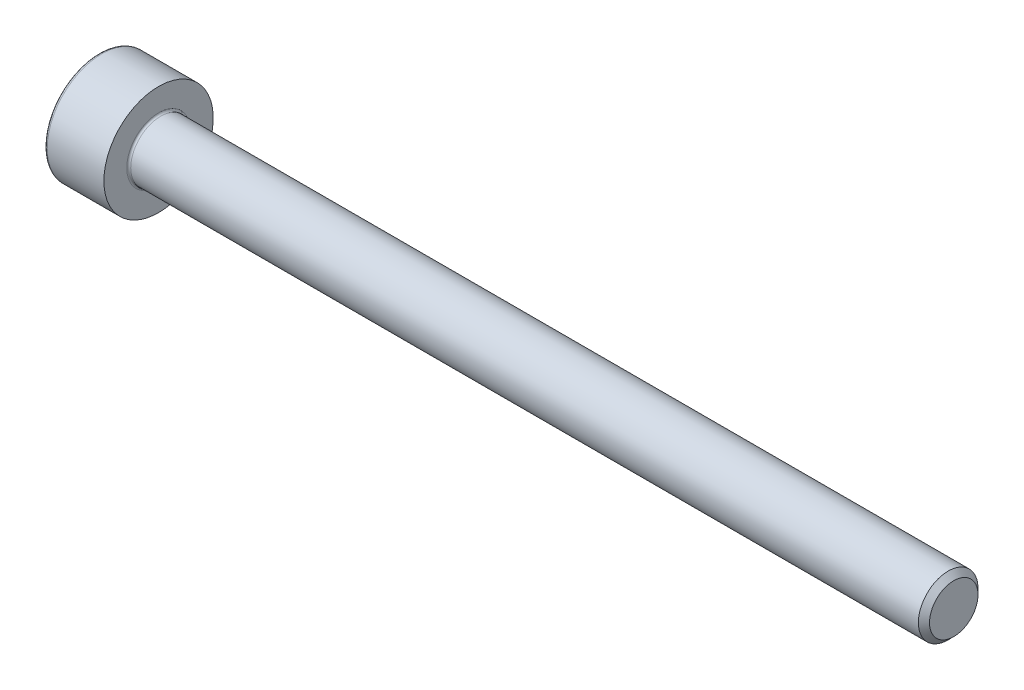
ISO-10303-21;
HEADER;
FILE_DESCRIPTION(('STEP AP214'),'2;1');
FILE_NAME('part.step','',(''),(''),'','','');
FILE_SCHEMA(('AUTOMOTIVE_DESIGN { 1 0 10303 214 1 1 1 1 }'));
ENDSEC;
DATA;
#1=APPLICATION_CONTEXT('core data for automotive mechanical design processes');
#2=APPLICATION_PROTOCOL_DEFINITION('international standard','automotive_design',2000,#1);
#3=PRODUCT_CONTEXT('',#1,'mechanical');
#4=PRODUCT('Part','Part','',(#3));
#5=PRODUCT_RELATED_PRODUCT_CATEGORY('part','',(#4));
#6=PRODUCT_DEFINITION_FORMATION('','',#4);
#7=PRODUCT_DEFINITION_CONTEXT('part definition',#1,'design');
#8=PRODUCT_DEFINITION('design','',#6,#7);
#9=PRODUCT_DEFINITION_SHAPE('','',#8);
#10=(LENGTH_UNIT() NAMED_UNIT(*) SI_UNIT(.MILLI.,.METRE.));
#11=(NAMED_UNIT(*) PLANE_ANGLE_UNIT() SI_UNIT($,.RADIAN.));
#12=(NAMED_UNIT(*) SI_UNIT($,.STERADIAN.) SOLID_ANGLE_UNIT());
#13=UNCERTAINTY_MEASURE_WITH_UNIT(LENGTH_MEASURE(1.E-05),#10,'distance_accuracy_value','');
#14=(GEOMETRIC_REPRESENTATION_CONTEXT(3) GLOBAL_UNCERTAINTY_ASSIGNED_CONTEXT((#13)) GLOBAL_UNIT_ASSIGNED_CONTEXT((#10,
#11,#12)) REPRESENTATION_CONTEXT('',''));
#15=CARTESIAN_POINT('',(0.,0.,0.));
#16=DIRECTION('',(0.,0.,1.));
#17=DIRECTION('',(1.,0.,0.));
#18=AXIS2_PLACEMENT_3D('',#15,#16,#17);
#19=CARTESIAN_POINT('',(0.,0.,0.));
#20=DIRECTION('',(-1.,0.,0.));
#21=DIRECTION('',(0.,0.,1.));
#22=AXIS2_PLACEMENT_3D('',#19,#20,#21);
#23=PLANE('',#22);
#24=DIRECTION('',(0.,-0.499999999999999,0.866025403784439));
#25=VECTOR('',#24,1.);
#26=CARTESIAN_POINT('',(0.,1.47801668912544,0.));
#27=LINE('',#26,#25);
#28=CARTESIAN_POINT('',(0.,1.47801668912544,0.));
#29=VERTEX_POINT('',#28);
#30=CARTESIAN_POINT('',(0.,0.73900834456272,1.28));
#31=VERTEX_POINT('',#30);
#32=EDGE_CURVE('E259',#29,#31,#27,.T.);
#33=ORIENTED_EDGE('',*,*,#32,.T.);
#34=DIRECTION('',(0.,1.,0.));
#35=VECTOR('',#34,1.);
#36=CARTESIAN_POINT('',(0.,-0.739008344562723,1.28));
#37=LINE('',#36,#35);
#38=CARTESIAN_POINT('',(0.,-0.739008344562723,1.28));
#39=VERTEX_POINT('',#38);
#40=EDGE_CURVE('E131',#39,#31,#37,.T.);
#41=ORIENTED_EDGE('',*,*,#40,.F.);
#42=DIRECTION('',(0.,-0.500000000000001,-0.866025403784438));
#43=VECTOR('',#42,1.);
#44=CARTESIAN_POINT('',(0.,-0.739008344562723,1.28));
#45=LINE('',#44,#43);
#46=CARTESIAN_POINT('',(0.,-1.47801668912545,0.));
#47=VERTEX_POINT('',#46);
#48=EDGE_CURVE('E262',#39,#47,#45,.T.);
#49=ORIENTED_EDGE('',*,*,#48,.T.);
#50=DIRECTION('',(0.,0.499999999999999,-0.866025403784439));
#51=VECTOR('',#50,1.);
#52=CARTESIAN_POINT('',(0.,-1.47801668912545,0.));
#53=LINE('',#52,#51);
#54=CARTESIAN_POINT('',(0.,-0.739008344562727,-1.28));
#55=VERTEX_POINT('',#54);
#56=EDGE_CURVE('E265',#47,#55,#53,.T.);
#57=ORIENTED_EDGE('',*,*,#56,.T.);
#58=DIRECTION('',(0.,-1.,0.));
#59=VECTOR('',#58,1.);
#60=CARTESIAN_POINT('',(0.,0.739008344562717,-1.28));
#61=LINE('',#60,#59);
#62=CARTESIAN_POINT('',(0.,0.739008344562717,-1.28));
#63=VERTEX_POINT('',#62);
#64=EDGE_CURVE('E268',#63,#55,#61,.T.);
#65=ORIENTED_EDGE('',*,*,#64,.F.);
#66=DIRECTION('',(0.,-0.500000000000001,-0.866025403784438));
#67=VECTOR('',#66,1.);
#68=CARTESIAN_POINT('',(0.,1.47801668912544,0.));
#69=LINE('',#68,#67);
#70=EDGE_CURVE('E126',#29,#63,#69,.T.);
#71=ORIENTED_EDGE('',*,*,#70,.F.);
#72=EDGE_LOOP('',(#33,#41,#49,#57,#65,#71));
#73=FACE_BOUND('',#72,.T.);
#74=CARTESIAN_POINT('',(0.,0.,0.));
#75=DIRECTION('',(-1.,0.,0.));
#76=DIRECTION('',(0.,0.,1.));
#77=AXIS2_PLACEMENT_3D('',#74,#75,#76);
#78=CIRCLE('',#77,2.6);
#79=CARTESIAN_POINT('',(0.,0.,2.6));
#80=VERTEX_POINT('',#79);
#81=EDGE_CURVE('E43',#80,#80,#78,.T.);
#82=ORIENTED_EDGE('',*,*,#81,.T.);
#83=EDGE_LOOP('',(#82));
#84=FACE_BOUND('',#83,.T.);
#85=ADVANCED_FACE('F35',(#73,#84),#23,.T.);
#86=CARTESIAN_POINT('',(-31.75,0.,0.));
#87=DIRECTION('',(-1.,0.,0.));
#88=DIRECTION('',(0.,0.,1.));
#89=AXIS2_PLACEMENT_3D('',#86,#87,#88);
#90=CYLINDRICAL_SURFACE('',#89,2.75);
#91=CARTESIAN_POINT('',(0.149999999999997,0.,0.));
#92=DIRECTION('',(-1.,0.,0.));
#93=DIRECTION('',(0.,0.,1.));
#94=AXIS2_PLACEMENT_3D('',#91,#92,#93);
#95=CIRCLE('',#94,2.75);
#96=CARTESIAN_POINT('',(0.149999999999997,0.,2.75));
#97=VERTEX_POINT('',#96);
#98=EDGE_CURVE('E11',#97,#97,#95,.F.);
#99=ORIENTED_EDGE('',*,*,#98,.T.);
#100=EDGE_LOOP('',(#99));
#101=FACE_BOUND('',#100,.T.);
#102=CARTESIAN_POINT('',(3.,0.,0.));
#103=DIRECTION('',(-1.,0.,0.));
#104=DIRECTION('',(0.,0.,1.));
#105=AXIS2_PLACEMENT_3D('',#102,#103,#104);
#106=CIRCLE('',#105,2.75);
#107=CARTESIAN_POINT('',(3.,0.,2.75));
#108=VERTEX_POINT('',#107);
#109=EDGE_CURVE('E149',#108,#108,#106,.T.);
#110=ORIENTED_EDGE('',*,*,#109,.T.);
#111=EDGE_LOOP('',(#110));
#112=FACE_BOUND('',#111,.T.);
#113=ADVANCED_FACE('F173',(#101,#112),#90,.T.);
#114=CARTESIAN_POINT('',(3.,2.75,0.));
#115=DIRECTION('',(1.,0.,0.));
#116=DIRECTION('',(0.,0.,-1.));
#117=AXIS2_PLACEMENT_3D('',#114,#115,#116);
#118=PLANE('',#117);
#119=CARTESIAN_POINT('',(3.,0.,0.));
#120=DIRECTION('',(1.,0.,0.));
#121=DIRECTION('',(0.,0.,-1.));
#122=AXIS2_PLACEMENT_3D('',#119,#120,#121);
#123=CIRCLE('',#122,1.59999999999999);
#124=CARTESIAN_POINT('',(3.,0.,-1.59999999999999));
#125=VERTEX_POINT('',#124);
#126=EDGE_CURVE('E152',#125,#125,#123,.F.);
#127=ORIENTED_EDGE('',*,*,#126,.T.);
#128=EDGE_LOOP('',(#127));
#129=FACE_BOUND('',#128,.T.);
#130=ORIENTED_EDGE('',*,*,#109,.F.);
#131=EDGE_LOOP('',(#130));
#132=FACE_BOUND('',#131,.T.);
#133=ADVANCED_FACE('F179',(#129,#132),#118,.T.);
#134=CARTESIAN_POINT('',(-31.75,0.,0.));
#135=DIRECTION('',(-1.,0.,0.));
#136=DIRECTION('',(0.,0.,1.));
#137=AXIS2_PLACEMENT_3D('',#134,#135,#136);
#138=CYLINDRICAL_SURFACE('',#137,1.49999999999999);
#139=CARTESIAN_POINT('',(3.1,0.,0.));
#140=DIRECTION('',(1.,0.,0.));
#141=DIRECTION('',(0.,0.,-1.));
#142=AXIS2_PLACEMENT_3D('',#139,#140,#141);
#143=CIRCLE('',#142,1.49999999999999);
#144=CARTESIAN_POINT('',(3.1,0.,-1.49999999999999));
#145=VERTEX_POINT('',#144);
#146=EDGE_CURVE('E155',#145,#145,#143,.T.);
#147=ORIENTED_EDGE('',*,*,#146,.T.);
#148=EDGE_LOOP('',(#147));
#149=FACE_BOUND('',#148,.T.);
#150=CARTESIAN_POINT('',(42.7195,0.,0.));
#151=DIRECTION('',(-1.,0.,0.));
#152=DIRECTION('',(0.,0.,1.));
#153=AXIS2_PLACEMENT_3D('',#150,#151,#152);
#154=CIRCLE('',#153,1.49999999999998);
#155=CARTESIAN_POINT('',(42.7195,0.,1.49999999999998));
#156=VERTEX_POINT('',#155);
#157=EDGE_CURVE('E146',#156,#156,#154,.T.);
#158=ORIENTED_EDGE('',*,*,#157,.T.);
#159=EDGE_LOOP('',(#158));
#160=FACE_BOUND('',#159,.T.);
#161=ADVANCED_FACE('F185',(#149,#160),#138,.T.);
#162=CARTESIAN_POINT('',(43.,0.,0.));
#163=DIRECTION('',(-1.,0.,0.));
#164=DIRECTION('',(0.,0.,1.));
#165=AXIS2_PLACEMENT_3D('',#162,#163,#164);
#166=CONICAL_SURFACE('',#165,1.2195,0.785398163397378);
#167=ORIENTED_EDGE('',*,*,#157,.F.);
#168=EDGE_LOOP('',(#167));
#169=FACE_BOUND('',#168,.T.);
#170=CARTESIAN_POINT('',(43.,0.,0.));
#171=DIRECTION('',(-1.,0.,0.));
#172=DIRECTION('',(0.,0.,1.));
#173=AXIS2_PLACEMENT_3D('',#170,#171,#172);
#174=CIRCLE('',#173,1.2195);
#175=CARTESIAN_POINT('',(43.,0.,1.2195));
#176=VERTEX_POINT('',#175);
#177=EDGE_CURVE('E142',#176,#176,#174,.T.);
#178=ORIENTED_EDGE('',*,*,#177,.T.);
#179=EDGE_LOOP('',(#178));
#180=FACE_BOUND('',#179,.T.);
#181=ADVANCED_FACE('F189',(#169,#180),#166,.T.);
#182=CARTESIAN_POINT('',(43.,1.2195,0.));
#183=DIRECTION('',(1.,0.,0.));
#184=DIRECTION('',(0.,0.,-1.));
#185=AXIS2_PLACEMENT_3D('',#182,#183,#184);
#186=PLANE('',#185);
#187=ORIENTED_EDGE('',*,*,#177,.F.);
#188=EDGE_LOOP('',(#187));
#189=FACE_BOUND('',#188,.T.);
#190=ADVANCED_FACE('F169',(#189),#186,.T.);
#191=CARTESIAN_POINT('',(3.1,0.,0.));
#192=DIRECTION('',(1.,0.,0.));
#193=DIRECTION('',(0.,0.,-1.));
#194=AXIS2_PLACEMENT_3D('',#191,#192,#193);
#195=TOROIDAL_SURFACE('',#194,1.59999999999999,0.1);
#196=ORIENTED_EDGE('',*,*,#146,.F.);
#197=EDGE_LOOP('',(#196));
#198=FACE_BOUND('',#197,.T.);
#199=ORIENTED_EDGE('',*,*,#126,.F.);
#200=EDGE_LOOP('',(#199));
#201=FACE_BOUND('',#200,.T.);
#202=ADVANCED_FACE('F162',(#198,#201),#195,.F.);
#203=CARTESIAN_POINT('',(0.149999999999997,0.,0.));
#204=DIRECTION('',(-1.,0.,0.));
#205=DIRECTION('',(0.,0.,1.));
#206=AXIS2_PLACEMENT_3D('',#203,#204,#205);
#207=TOROIDAL_SURFACE('',#206,2.6,0.15);
#208=ORIENTED_EDGE('',*,*,#98,.F.);
#209=EDGE_LOOP('',(#208));
#210=FACE_BOUND('',#209,.T.);
#211=ORIENTED_EDGE('',*,*,#81,.F.);
#212=EDGE_LOOP('',(#211));
#213=FACE_BOUND('',#212,.T.);
#214=ADVANCED_FACE('F37',(#210,#213),#207,.T.);
#215=CARTESIAN_POINT('',(1.3,1.47801668912544,0.));
#216=DIRECTION('',(0.,-0.866025403784439,-0.499999999999999));
#217=DIRECTION('',(0.,0.499999999999999,-0.866025403784439));
#218=AXIS2_PLACEMENT_3D('',#215,#216,#217);
#219=PLANE('',#218);
#220=ORIENTED_EDGE('',*,*,#32,.F.);
#221=DIRECTION('',(-1.,0.,0.));
#222=VECTOR('',#221,1.);
#223=CARTESIAN_POINT('',(1.3,1.47801668912544,0.));
#224=LINE('',#223,#222);
#225=CARTESIAN_POINT('',(1.3,1.47801668912544,0.));
#226=VERTEX_POINT('',#225);
#227=EDGE_CURVE('E249',#226,#29,#224,.T.);
#228=ORIENTED_EDGE('',*,*,#227,.F.);
#229=DIRECTION('',(0.,-0.499999999999999,0.866025403784439));
#230=VECTOR('',#229,1.);
#231=CARTESIAN_POINT('',(1.3,1.47801668912544,0.));
#232=LINE('',#231,#230);
#233=CARTESIAN_POINT('',(1.3,1.10851251684408,0.639999999999997));
#234=VERTEX_POINT('',#233);
#235=EDGE_CURVE('E118',#226,#234,#232,.T.);
#236=ORIENTED_EDGE('',*,*,#235,.T.);
#237=CARTESIAN_POINT('',(1.3,0.73900834456272,1.28));
#238=VERTEX_POINT('',#237);
#239=EDGE_CURVE('E109',#234,#238,#232,.T.);
#240=ORIENTED_EDGE('',*,*,#239,.T.);
#241=DIRECTION('',(-1.,0.,0.));
#242=VECTOR('',#241,1.);
#243=CARTESIAN_POINT('',(1.3,0.73900834456272,1.28));
#244=LINE('',#243,#242);
#245=EDGE_CURVE('E123',#238,#31,#244,.T.);
#246=ORIENTED_EDGE('',*,*,#245,.T.);
#247=EDGE_LOOP('',(#220,#228,#236,#240,#246));
#248=FACE_BOUND('',#247,.T.);
#249=ADVANCED_FACE('F122',(#248),#219,.T.);
#250=CARTESIAN_POINT('',(1.3,-0.739008344562723,1.28));
#251=DIRECTION('',(0.,0.,1.));
#252=DIRECTION('',(0.,-1.,0.));
#253=AXIS2_PLACEMENT_3D('',#250,#251,#252);
#254=PLANE('',#253);
#255=ORIENTED_EDGE('',*,*,#40,.T.);
#256=ORIENTED_EDGE('',*,*,#245,.F.);
#257=DIRECTION('',(0.,1.,0.));
#258=VECTOR('',#257,1.);
#259=CARTESIAN_POINT('',(1.3,-0.739008344562723,1.28));
#260=LINE('',#259,#258);
#261=CARTESIAN_POINT('',(1.3,0.,1.28));
#262=VERTEX_POINT('',#261);
#263=EDGE_CURVE('E106',#262,#238,#260,.T.);
#264=ORIENTED_EDGE('',*,*,#263,.F.);
#265=CARTESIAN_POINT('',(1.3,-0.739008344562723,1.28));
#266=VERTEX_POINT('',#265);
#267=EDGE_CURVE('E117',#266,#262,#260,.T.);
#268=ORIENTED_EDGE('',*,*,#267,.F.);
#269=DIRECTION('',(-1.,0.,0.));
#270=VECTOR('',#269,1.);
#271=CARTESIAN_POINT('',(1.3,-0.739008344562723,1.28));
#272=LINE('',#271,#270);
#273=EDGE_CURVE('E133',#266,#39,#272,.T.);
#274=ORIENTED_EDGE('',*,*,#273,.T.);
#275=EDGE_LOOP('',(#255,#256,#264,#268,#274));
#276=FACE_BOUND('',#275,.T.);
#277=ADVANCED_FACE('F128',(#276),#254,.F.);
#278=CARTESIAN_POINT('',(1.3,-0.739008344562723,1.28));
#279=DIRECTION('',(0.,0.866025403784438,-0.500000000000001));
#280=DIRECTION('',(0.,0.500000000000001,0.866025403784438));
#281=AXIS2_PLACEMENT_3D('',#278,#279,#280);
#282=PLANE('',#281);
#283=ORIENTED_EDGE('',*,*,#48,.F.);
#284=ORIENTED_EDGE('',*,*,#273,.F.);
#285=DIRECTION('',(0.,-0.500000000000001,-0.866025403784438));
#286=VECTOR('',#285,1.);
#287=CARTESIAN_POINT('',(1.3,-0.739008344562723,1.28));
#288=LINE('',#287,#286);
#289=CARTESIAN_POINT('',(1.3,-1.10851251684408,0.640000000000002));
#290=VERTEX_POINT('',#289);
#291=EDGE_CURVE('E288',#266,#290,#288,.T.);
#292=ORIENTED_EDGE('',*,*,#291,.T.);
#293=CARTESIAN_POINT('',(1.3,-1.47801668912545,0.));
#294=VERTEX_POINT('',#293);
#295=EDGE_CURVE('E277',#290,#294,#288,.T.);
#296=ORIENTED_EDGE('',*,*,#295,.T.);
#297=DIRECTION('',(-1.,0.,0.));
#298=VECTOR('',#297,1.);
#299=CARTESIAN_POINT('',(1.3,-1.47801668912545,0.));
#300=LINE('',#299,#298);
#301=EDGE_CURVE('E138',#294,#47,#300,.T.);
#302=ORIENTED_EDGE('',*,*,#301,.T.);
#303=EDGE_LOOP('',(#283,#284,#292,#296,#302));
#304=FACE_BOUND('',#303,.T.);
#305=ADVANCED_FACE('F203',(#304),#282,.T.);
#306=CARTESIAN_POINT('',(1.3,-1.47801668912545,0.));
#307=DIRECTION('',(0.,0.866025403784439,0.499999999999999));
#308=DIRECTION('',(0.,-0.499999999999999,0.866025403784439));
#309=AXIS2_PLACEMENT_3D('',#306,#307,#308);
#310=PLANE('',#309);
#311=ORIENTED_EDGE('',*,*,#56,.F.);
#312=ORIENTED_EDGE('',*,*,#301,.F.);
#313=DIRECTION('',(0.,0.499999999999999,-0.866025403784439));
#314=VECTOR('',#313,1.);
#315=CARTESIAN_POINT('',(1.3,-1.47801668912545,0.));
#316=LINE('',#315,#314);
#317=CARTESIAN_POINT('',(1.3,-1.10851251684409,-0.640000000000001));
#318=VERTEX_POINT('',#317);
#319=EDGE_CURVE('E255',#294,#318,#316,.T.);
#320=ORIENTED_EDGE('',*,*,#319,.T.);
#321=CARTESIAN_POINT('',(1.3,-0.739008344562727,-1.28));
#322=VERTEX_POINT('',#321);
#323=EDGE_CURVE('E287',#318,#322,#316,.T.);
#324=ORIENTED_EDGE('',*,*,#323,.T.);
#325=DIRECTION('',(-1.,0.,0.));
#326=VECTOR('',#325,1.);
#327=CARTESIAN_POINT('',(1.3,-0.739008344562727,-1.28));
#328=LINE('',#327,#326);
#329=EDGE_CURVE('E248',#322,#55,#328,.T.);
#330=ORIENTED_EDGE('',*,*,#329,.T.);
#331=EDGE_LOOP('',(#311,#312,#320,#324,#330));
#332=FACE_BOUND('',#331,.T.);
#333=ADVANCED_FACE('F206',(#332),#310,.T.);
#334=CARTESIAN_POINT('',(1.3,0.739008344562717,-1.28));
#335=DIRECTION('',(0.,0.,-1.));
#336=DIRECTION('',(0.,1.,0.));
#337=AXIS2_PLACEMENT_3D('',#334,#335,#336);
#338=PLANE('',#337);
#339=ORIENTED_EDGE('',*,*,#64,.T.);
#340=ORIENTED_EDGE('',*,*,#329,.F.);
#341=DIRECTION('',(0.,-1.,0.));
#342=VECTOR('',#341,1.);
#343=CARTESIAN_POINT('',(1.3,0.739008344562717,-1.28));
#344=LINE('',#343,#342);
#345=CARTESIAN_POINT('',(1.3,0.,-1.28));
#346=VERTEX_POINT('',#345);
#347=EDGE_CURVE('E252',#346,#322,#344,.T.);
#348=ORIENTED_EDGE('',*,*,#347,.F.);
#349=CARTESIAN_POINT('',(1.3,0.739008344562717,-1.28));
#350=VERTEX_POINT('',#349);
#351=EDGE_CURVE('E50',#350,#346,#344,.T.);
#352=ORIENTED_EDGE('',*,*,#351,.F.);
#353=DIRECTION('',(-1.,0.,0.));
#354=VECTOR('',#353,1.);
#355=CARTESIAN_POINT('',(1.3,0.739008344562717,-1.28));
#356=LINE('',#355,#354);
#357=EDGE_CURVE('E245',#350,#63,#356,.T.);
#358=ORIENTED_EDGE('',*,*,#357,.T.);
#359=EDGE_LOOP('',(#339,#340,#348,#352,#358));
#360=FACE_BOUND('',#359,.T.);
#361=ADVANCED_FACE('F210',(#360),#338,.F.);
#362=CARTESIAN_POINT('',(1.3,1.47801668912544,0.));
#363=DIRECTION('',(0.,0.866025403784438,-0.500000000000001));
#364=DIRECTION('',(0.,0.500000000000001,0.866025403784438));
#365=AXIS2_PLACEMENT_3D('',#362,#363,#364);
#366=PLANE('',#365);
#367=ORIENTED_EDGE('',*,*,#70,.T.);
#368=ORIENTED_EDGE('',*,*,#357,.F.);
#369=DIRECTION('',(0.,-0.500000000000001,-0.866025403784438));
#370=VECTOR('',#369,1.);
#371=CARTESIAN_POINT('',(1.3,1.47801668912544,0.));
#372=LINE('',#371,#370);
#373=CARTESIAN_POINT('',(1.3,1.10851251684408,-0.640000000000001));
#374=VERTEX_POINT('',#373);
#375=EDGE_CURVE('E235',#374,#350,#372,.T.);
#376=ORIENTED_EDGE('',*,*,#375,.F.);
#377=EDGE_CURVE('E241',#226,#374,#372,.T.);
#378=ORIENTED_EDGE('',*,*,#377,.F.);
#379=ORIENTED_EDGE('',*,*,#227,.T.);
#380=EDGE_LOOP('',(#367,#368,#376,#378,#379));
#381=FACE_BOUND('',#380,.T.);
#382=ADVANCED_FACE('F214',(#381),#366,.F.);
#383=CARTESIAN_POINT('',(1.3,1.47801668912544,0.));
#384=DIRECTION('',(1.,0.,0.));
#385=DIRECTION('',(0.,0.,-1.));
#386=AXIS2_PLACEMENT_3D('',#383,#384,#385);
#387=PLANE('',#386);
#388=ORIENTED_EDGE('',*,*,#347,.T.);
#389=ORIENTED_EDGE('',*,*,#323,.F.);
#390=CARTESIAN_POINT('',(1.3,0.,0.));
#391=DIRECTION('',(-1.,0.,0.));
#392=DIRECTION('',(0.,0.,1.));
#393=AXIS2_PLACEMENT_3D('',#390,#391,#392);
#394=CIRCLE('',#393,1.28);
#395=EDGE_CURVE('E283',#346,#318,#394,.T.);
#396=ORIENTED_EDGE('',*,*,#395,.F.);
#397=EDGE_LOOP('',(#388,#389,#396));
#398=FACE_BOUND('',#397,.T.);
#399=ADVANCED_FACE('F218',(#398),#387,.F.);
#400=ORIENTED_EDGE('',*,*,#319,.F.);
#401=ORIENTED_EDGE('',*,*,#295,.F.);
#402=EDGE_CURVE('E136',#318,#290,#394,.T.);
#403=ORIENTED_EDGE('',*,*,#402,.F.);
#404=EDGE_LOOP('',(#400,#401,#403));
#405=FACE_BOUND('',#404,.T.);
#406=ADVANCED_FACE('F221',(#405),#387,.F.);
#407=ORIENTED_EDGE('',*,*,#291,.F.);
#408=ORIENTED_EDGE('',*,*,#267,.T.);
#409=EDGE_CURVE('E132',#290,#262,#394,.T.);
#410=ORIENTED_EDGE('',*,*,#409,.F.);
#411=EDGE_LOOP('',(#407,#408,#410));
#412=FACE_BOUND('',#411,.T.);
#413=ADVANCED_FACE('F226',(#412),#387,.F.);
#414=ORIENTED_EDGE('',*,*,#263,.T.);
#415=ORIENTED_EDGE('',*,*,#239,.F.);
#416=EDGE_CURVE('E112',#262,#234,#394,.T.);
#417=ORIENTED_EDGE('',*,*,#416,.F.);
#418=EDGE_LOOP('',(#414,#415,#417));
#419=FACE_BOUND('',#418,.T.);
#420=ADVANCED_FACE('F108',(#419),#387,.F.);
#421=ORIENTED_EDGE('',*,*,#235,.F.);
#422=ORIENTED_EDGE('',*,*,#377,.T.);
#423=EDGE_CURVE('E143',#234,#374,#394,.T.);
#424=ORIENTED_EDGE('',*,*,#423,.F.);
#425=EDGE_LOOP('',(#421,#422,#424));
#426=FACE_BOUND('',#425,.T.);
#427=ADVANCED_FACE('F229',(#426),#387,.F.);
#428=ORIENTED_EDGE('',*,*,#375,.T.);
#429=ORIENTED_EDGE('',*,*,#351,.T.);
#430=EDGE_CURVE('E238',#374,#346,#394,.T.);
#431=ORIENTED_EDGE('',*,*,#430,.F.);
#432=EDGE_LOOP('',(#428,#429,#431));
#433=FACE_BOUND('',#432,.T.);
#434=ADVANCED_FACE('F199',(#433),#387,.F.);
#435=CARTESIAN_POINT('',(1.3,0.,0.));
#436=DIRECTION('',(-1.,0.,0.));
#437=DIRECTION('',(0.,0.,1.));
#438=AXIS2_PLACEMENT_3D('',#435,#436,#437);
#439=CONICAL_SURFACE('',#438,1.28,1.04719755119659);
#440=CARTESIAN_POINT('',(2.03900834456273,0.,0.));
#441=VERTEX_POINT('',#440);
#442=VERTEX_LOOP('',#441);
#443=FACE_BOUND('',#442,.T.);
#444=ORIENTED_EDGE('',*,*,#416,.T.);
#445=ORIENTED_EDGE('',*,*,#423,.T.);
#446=ORIENTED_EDGE('',*,*,#430,.T.);
#447=ORIENTED_EDGE('',*,*,#395,.T.);
#448=ORIENTED_EDGE('',*,*,#402,.T.);
#449=ORIENTED_EDGE('',*,*,#409,.T.);
#450=EDGE_LOOP('',(#444,#445,#446,#447,#448,#449));
#451=FACE_BOUND('',#450,.T.);
#452=ADVANCED_FACE('F197',(#443,#451),#439,.F.);
#453=CLOSED_SHELL('',(#85,#113,#133,#161,#181,#190,#202,#214,#249,#277,#305,#333,#361,#382,#399,
#406,#413,#420,#427,#434,#452));
#454=MANIFOLD_SOLID_BREP('B2',#453);
#455=ADVANCED_BREP_SHAPE_REPRESENTATION('',(#18,#454),#14);
#456=SHAPE_DEFINITION_REPRESENTATION(#9,#455);
ENDSEC;
END-ISO-10303-21;
